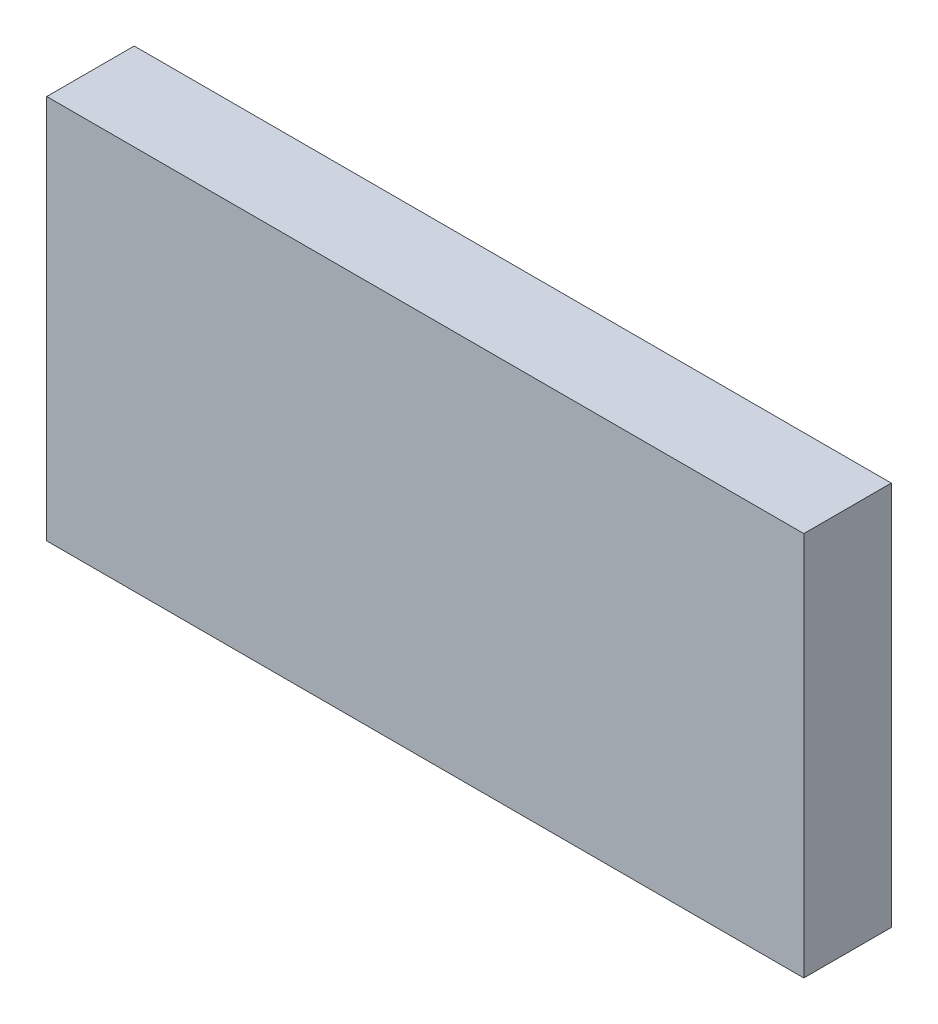
ISO-10303-21;
HEADER;
FILE_DESCRIPTION(('STEP AP214'),'2;1');
FILE_NAME('part.step','',(''),(''),'','','');
FILE_SCHEMA(('AUTOMOTIVE_DESIGN { 1 0 10303 214 1 1 1 1 }'));
ENDSEC;
DATA;
#1=APPLICATION_CONTEXT('core data for automotive mechanical design processes');
#2=APPLICATION_PROTOCOL_DEFINITION('international standard','automotive_design',2000,#1);
#3=PRODUCT_CONTEXT('',#1,'mechanical');
#4=PRODUCT('Part','Part','',(#3));
#5=PRODUCT_RELATED_PRODUCT_CATEGORY('part','',(#4));
#6=PRODUCT_DEFINITION_FORMATION('','',#4);
#7=PRODUCT_DEFINITION_CONTEXT('part definition',#1,'design');
#8=PRODUCT_DEFINITION('design','',#6,#7);
#9=PRODUCT_DEFINITION_SHAPE('','',#8);
#10=(LENGTH_UNIT() NAMED_UNIT(*) SI_UNIT(.MILLI.,.METRE.));
#11=(NAMED_UNIT(*) PLANE_ANGLE_UNIT() SI_UNIT($,.RADIAN.));
#12=(NAMED_UNIT(*) SI_UNIT($,.STERADIAN.) SOLID_ANGLE_UNIT());
#13=UNCERTAINTY_MEASURE_WITH_UNIT(LENGTH_MEASURE(1.E-05),#10,'distance_accuracy_value','');
#14=(GEOMETRIC_REPRESENTATION_CONTEXT(3) GLOBAL_UNCERTAINTY_ASSIGNED_CONTEXT((#13)) GLOBAL_UNIT_ASSIGNED_CONTEXT((#10,
#11,#12)) REPRESENTATION_CONTEXT('',''));
#15=CARTESIAN_POINT('',(0.,0.,0.));
#16=DIRECTION('',(0.,0.,1.));
#17=DIRECTION('',(1.,0.,0.));
#18=AXIS2_PLACEMENT_3D('',#15,#16,#17);
#19=CARTESIAN_POINT('',(0.5795,0.18,0.));
#20=DIRECTION('',(1.,0.,0.));
#21=DIRECTION('',(0.,0.,1.));
#22=AXIS2_PLACEMENT_3D('',#19,#20,#21);
#23=PLANE('',#22);
#24=DIRECTION('',(0.,1.,0.));
#25=VECTOR('',#24,1.);
#26=CARTESIAN_POINT('',(0.5795,0.18,0.1));
#27=LINE('',#26,#25);
#28=CARTESIAN_POINT('',(0.5795,0.18,0.1));
#29=VERTEX_POINT('',#28);
#30=CARTESIAN_POINT('',(0.5795,0.62,0.1));
#31=VERTEX_POINT('',#30);
#32=EDGE_CURVE('E11',#29,#31,#27,.T.);
#33=ORIENTED_EDGE('',*,*,#32,.T.);
#34=DIRECTION('',(0.,0.,1.));
#35=VECTOR('',#34,1.);
#36=CARTESIAN_POINT('',(0.5795,0.62,0.));
#37=LINE('',#36,#35);
#38=CARTESIAN_POINT('',(0.5795,0.62,0.));
#39=VERTEX_POINT('',#38);
#40=EDGE_CURVE('E24',#39,#31,#37,.T.);
#41=ORIENTED_EDGE('',*,*,#40,.F.);
#42=DIRECTION('',(0.,1.,0.));
#43=VECTOR('',#42,1.);
#44=CARTESIAN_POINT('',(0.5795,0.18,0.));
#45=LINE('',#44,#43);
#46=CARTESIAN_POINT('',(0.5795,0.18,0.));
#47=VERTEX_POINT('',#46);
#48=EDGE_CURVE('E86',#47,#39,#45,.T.);
#49=ORIENTED_EDGE('',*,*,#48,.F.);
#50=DIRECTION('',(0.,0.,1.));
#51=VECTOR('',#50,1.);
#52=CARTESIAN_POINT('',(0.5795,0.18,0.));
#53=LINE('',#52,#51);
#54=EDGE_CURVE('E36',#47,#29,#53,.T.);
#55=ORIENTED_EDGE('',*,*,#54,.T.);
#56=EDGE_LOOP('',(#33,#41,#49,#55));
#57=FACE_BOUND('',#56,.T.);
#58=ADVANCED_FACE('F17',(#57),#23,.F.);
#59=CARTESIAN_POINT('',(1.445,0.18,0.));
#60=DIRECTION('',(1.,0.,0.));
#61=DIRECTION('',(0.,0.,1.));
#62=AXIS2_PLACEMENT_3D('',#59,#60,#61);
#63=PLANE('',#62);
#64=DIRECTION('',(0.,0.,1.));
#65=VECTOR('',#64,1.);
#66=CARTESIAN_POINT('',(1.445,0.18,0.));
#67=LINE('',#66,#65);
#68=CARTESIAN_POINT('',(1.445,0.18,0.));
#69=VERTEX_POINT('',#68);
#70=CARTESIAN_POINT('',(1.445,0.18,0.1));
#71=VERTEX_POINT('',#70);
#72=EDGE_CURVE('E83',#69,#71,#67,.T.);
#73=ORIENTED_EDGE('',*,*,#72,.F.);
#74=DIRECTION('',(0.,1.,0.));
#75=VECTOR('',#74,1.);
#76=CARTESIAN_POINT('',(1.445,0.18,0.));
#77=LINE('',#76,#75);
#78=CARTESIAN_POINT('',(1.445,0.62,0.));
#79=VERTEX_POINT('',#78);
#80=EDGE_CURVE('E63',#69,#79,#77,.T.);
#81=ORIENTED_EDGE('',*,*,#80,.T.);
#82=DIRECTION('',(0.,0.,1.));
#83=VECTOR('',#82,1.);
#84=CARTESIAN_POINT('',(1.445,0.62,0.));
#85=LINE('',#84,#83);
#86=CARTESIAN_POINT('',(1.445,0.62,0.1));
#87=VERTEX_POINT('',#86);
#88=EDGE_CURVE('E57',#79,#87,#85,.T.);
#89=ORIENTED_EDGE('',*,*,#88,.T.);
#90=DIRECTION('',(0.,1.,0.));
#91=VECTOR('',#90,1.);
#92=CARTESIAN_POINT('',(1.445,0.18,0.1));
#93=LINE('',#92,#91);
#94=EDGE_CURVE('E60',#71,#87,#93,.T.);
#95=ORIENTED_EDGE('',*,*,#94,.F.);
#96=EDGE_LOOP('',(#73,#81,#89,#95));
#97=FACE_BOUND('',#96,.T.);
#98=ADVANCED_FACE('F59',(#97),#63,.T.);
#99=CARTESIAN_POINT('',(0.5795,0.18,0.));
#100=DIRECTION('',(0.,1.,0.));
#101=DIRECTION('',(0.,0.,1.));
#102=AXIS2_PLACEMENT_3D('',#99,#100,#101);
#103=PLANE('',#102);
#104=ORIENTED_EDGE('',*,*,#72,.T.);
#105=DIRECTION('',(1.,0.,0.));
#106=VECTOR('',#105,1.);
#107=CARTESIAN_POINT('',(0.5795,0.18,0.1));
#108=LINE('',#107,#106);
#109=EDGE_CURVE('E71',#29,#71,#108,.T.);
#110=ORIENTED_EDGE('',*,*,#109,.F.);
#111=ORIENTED_EDGE('',*,*,#54,.F.);
#112=DIRECTION('',(1.,0.,0.));
#113=VECTOR('',#112,1.);
#114=CARTESIAN_POINT('',(0.5795,0.18,0.));
#115=LINE('',#114,#113);
#116=EDGE_CURVE('E76',#47,#69,#115,.T.);
#117=ORIENTED_EDGE('',*,*,#116,.T.);
#118=EDGE_LOOP('',(#104,#110,#111,#117));
#119=FACE_BOUND('',#118,.T.);
#120=ADVANCED_FACE('F91',(#119),#103,.F.);
#121=CARTESIAN_POINT('',(0.5795,0.62,0.));
#122=DIRECTION('',(0.,1.,0.));
#123=DIRECTION('',(0.,0.,1.));
#124=AXIS2_PLACEMENT_3D('',#121,#122,#123);
#125=PLANE('',#124);
#126=DIRECTION('',(1.,0.,0.));
#127=VECTOR('',#126,1.);
#128=CARTESIAN_POINT('',(0.5795,0.62,0.));
#129=LINE('',#128,#127);
#130=EDGE_CURVE('E74',#39,#79,#129,.T.);
#131=ORIENTED_EDGE('',*,*,#130,.F.);
#132=ORIENTED_EDGE('',*,*,#40,.T.);
#133=DIRECTION('',(1.,0.,0.));
#134=VECTOR('',#133,1.);
#135=CARTESIAN_POINT('',(0.5795,0.62,0.1));
#136=LINE('',#135,#134);
#137=EDGE_CURVE('E69',#31,#87,#136,.T.);
#138=ORIENTED_EDGE('',*,*,#137,.T.);
#139=ORIENTED_EDGE('',*,*,#88,.F.);
#140=EDGE_LOOP('',(#131,#132,#138,#139));
#141=FACE_BOUND('',#140,.T.);
#142=ADVANCED_FACE('F73',(#141),#125,.T.);
#143=CARTESIAN_POINT('',(0.5795,0.18,0.));
#144=DIRECTION('',(0.,0.,1.));
#145=DIRECTION('',(1.,0.,0.));
#146=AXIS2_PLACEMENT_3D('',#143,#144,#145);
#147=PLANE('',#146);
#148=ORIENTED_EDGE('',*,*,#130,.T.);
#149=ORIENTED_EDGE('',*,*,#80,.F.);
#150=ORIENTED_EDGE('',*,*,#116,.F.);
#151=ORIENTED_EDGE('',*,*,#48,.T.);
#152=EDGE_LOOP('',(#148,#149,#150,#151));
#153=FACE_BOUND('',#152,.T.);
#154=ADVANCED_FACE('F89',(#153),#147,.F.);
#155=CARTESIAN_POINT('',(0.5795,0.18,0.1));
#156=DIRECTION('',(0.,0.,1.));
#157=DIRECTION('',(1.,0.,0.));
#158=AXIS2_PLACEMENT_3D('',#155,#156,#157);
#159=PLANE('',#158);
#160=ORIENTED_EDGE('',*,*,#32,.F.);
#161=ORIENTED_EDGE('',*,*,#109,.T.);
#162=ORIENTED_EDGE('',*,*,#94,.T.);
#163=ORIENTED_EDGE('',*,*,#137,.F.);
#164=EDGE_LOOP('',(#160,#161,#162,#163));
#165=FACE_BOUND('',#164,.T.);
#166=ADVANCED_FACE('F68',(#165),#159,.T.);
#167=CLOSED_SHELL('',(#58,#98,#120,#142,#154,#166));
#168=MANIFOLD_SOLID_BREP('B1',#167);
#169=ADVANCED_BREP_SHAPE_REPRESENTATION('',(#18,#168),#14);
#170=SHAPE_DEFINITION_REPRESENTATION(#9,#169);
ENDSEC;
END-ISO-10303-21;
